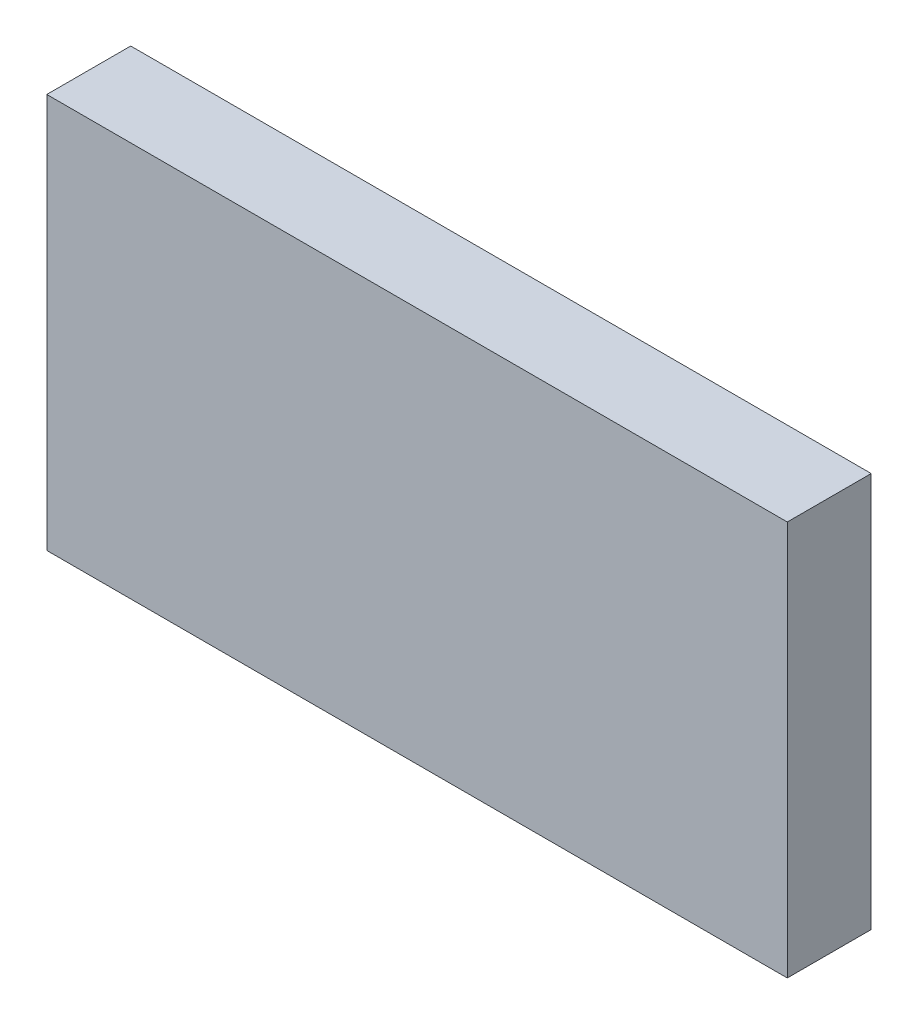
ISO-10303-21;
HEADER;
FILE_DESCRIPTION(('STEP AP214'),'2;1');
FILE_NAME('part.step','',(''),(''),'','','');
FILE_SCHEMA(('AUTOMOTIVE_DESIGN { 1 0 10303 214 1 1 1 1 }'));
ENDSEC;
DATA;
#1=APPLICATION_CONTEXT('core data for automotive mechanical design processes');
#2=APPLICATION_PROTOCOL_DEFINITION('international standard','automotive_design',2000,#1);
#3=PRODUCT_CONTEXT('',#1,'mechanical');
#4=PRODUCT('Part','Part','',(#3));
#5=PRODUCT_RELATED_PRODUCT_CATEGORY('part','',(#4));
#6=PRODUCT_DEFINITION_FORMATION('','',#4);
#7=PRODUCT_DEFINITION_CONTEXT('part definition',#1,'design');
#8=PRODUCT_DEFINITION('design','',#6,#7);
#9=PRODUCT_DEFINITION_SHAPE('','',#8);
#10=(LENGTH_UNIT() NAMED_UNIT(*) SI_UNIT(.MILLI.,.METRE.));
#11=(NAMED_UNIT(*) PLANE_ANGLE_UNIT() SI_UNIT($,.RADIAN.));
#12=(NAMED_UNIT(*) SI_UNIT($,.STERADIAN.) SOLID_ANGLE_UNIT());
#13=UNCERTAINTY_MEASURE_WITH_UNIT(LENGTH_MEASURE(1.E-05),#10,'distance_accuracy_value','');
#14=(GEOMETRIC_REPRESENTATION_CONTEXT(3) GLOBAL_UNCERTAINTY_ASSIGNED_CONTEXT((#13)) GLOBAL_UNIT_ASSIGNED_CONTEXT((#10,
#11,#12)) REPRESENTATION_CONTEXT('',''));
#15=CARTESIAN_POINT('',(0.,0.,0.));
#16=DIRECTION('',(0.,0.,1.));
#17=DIRECTION('',(1.,0.,0.));
#18=AXIS2_PLACEMENT_3D('',#15,#16,#17);
#19=CARTESIAN_POINT('',(-0.7499985,0.40000174,0.16999966));
#20=DIRECTION('',(0.,0.,1.));
#21=DIRECTION('',(1.,0.,0.));
#22=AXIS2_PLACEMENT_3D('',#19,#20,#21);
#23=PLANE('',#22);
#24=DIRECTION('',(0.,1.,0.));
#25=VECTOR('',#24,1.);
#26=CARTESIAN_POINT('',(0.75000104,0.40000174,0.16999966));
#27=LINE('',#26,#25);
#28=CARTESIAN_POINT('',(0.75000104,0.40000174,0.16999966));
#29=VERTEX_POINT('',#28);
#30=CARTESIAN_POINT('',(0.75000104,-0.3999992,0.16999966));
#31=VERTEX_POINT('',#30);
#32=EDGE_CURVE('E52',#29,#31,#27,.F.);
#33=ORIENTED_EDGE('',*,*,#32,.F.);
#34=DIRECTION('',(1.,0.,0.));
#35=VECTOR('',#34,1.);
#36=CARTESIAN_POINT('',(-0.7499985,0.40000174,0.16999966));
#37=LINE('',#36,#35);
#38=CARTESIAN_POINT('',(-0.7499985,0.40000174,0.16999966));
#39=VERTEX_POINT('',#38);
#40=EDGE_CURVE('E67',#39,#29,#37,.T.);
#41=ORIENTED_EDGE('',*,*,#40,.F.);
#42=DIRECTION('',(0.,1.,0.));
#43=VECTOR('',#42,1.);
#44=CARTESIAN_POINT('',(-0.7499985,-0.3999992,0.16999966));
#45=LINE('',#44,#43);
#46=CARTESIAN_POINT('',(-0.7499985,-0.3999992,0.16999966));
#47=VERTEX_POINT('',#46);
#48=EDGE_CURVE('E19',#47,#39,#45,.T.);
#49=ORIENTED_EDGE('',*,*,#48,.F.);
#50=DIRECTION('',(1.,0.,0.));
#51=VECTOR('',#50,1.);
#52=CARTESIAN_POINT('',(0.75000104,-0.3999992,0.16999966));
#53=LINE('',#52,#51);
#54=EDGE_CURVE('E57',#31,#47,#53,.F.);
#55=ORIENTED_EDGE('',*,*,#54,.F.);
#56=EDGE_LOOP('',(#33,#41,#49,#55));
#57=FACE_BOUND('',#56,.T.);
#58=ADVANCED_FACE('F16',(#57),#23,.T.);
#59=CARTESIAN_POINT('',(-0.7499985,-0.3999992,0.));
#60=DIRECTION('',(-1.,0.,0.));
#61=DIRECTION('',(0.,0.,1.));
#62=AXIS2_PLACEMENT_3D('',#59,#60,#61);
#63=PLANE('',#62);
#64=DIRECTION('',(0.,0.,1.));
#65=VECTOR('',#64,1.);
#66=CARTESIAN_POINT('',(-0.7499985,0.40000174,0.));
#67=LINE('',#66,#65);
#68=CARTESIAN_POINT('',(-0.7499985,0.40000174,0.));
#69=VERTEX_POINT('',#68);
#70=EDGE_CURVE('E78',#69,#39,#67,.T.);
#71=ORIENTED_EDGE('',*,*,#70,.F.);
#72=DIRECTION('',(0.,1.,0.));
#73=VECTOR('',#72,1.);
#74=CARTESIAN_POINT('',(-0.7499985,0.40000174,0.));
#75=LINE('',#74,#73);
#76=CARTESIAN_POINT('',(-0.7499985,-0.3999992,0.));
#77=VERTEX_POINT('',#76);
#78=EDGE_CURVE('E73',#69,#77,#75,.F.);
#79=ORIENTED_EDGE('',*,*,#78,.T.);
#80=DIRECTION('',(0.,0.,-1.));
#81=VECTOR('',#80,1.);
#82=CARTESIAN_POINT('',(-0.7499985,-0.3999992,0.));
#83=LINE('',#82,#81);
#84=EDGE_CURVE('E62',#47,#77,#83,.T.);
#85=ORIENTED_EDGE('',*,*,#84,.F.);
#86=ORIENTED_EDGE('',*,*,#48,.T.);
#87=EDGE_LOOP('',(#71,#79,#85,#86));
#88=FACE_BOUND('',#87,.T.);
#89=ADVANCED_FACE('F72',(#88),#63,.T.);
#90=CARTESIAN_POINT('',(0.75000104,-0.3999992,0.));
#91=DIRECTION('',(0.,-1.,0.));
#92=DIRECTION('',(0.,0.,-1.));
#93=AXIS2_PLACEMENT_3D('',#90,#91,#92);
#94=PLANE('',#93);
#95=ORIENTED_EDGE('',*,*,#84,.T.);
#96=DIRECTION('',(1.,0.,0.));
#97=VECTOR('',#96,1.);
#98=CARTESIAN_POINT('',(-0.7499985,-0.3999992,0.));
#99=LINE('',#98,#97);
#100=CARTESIAN_POINT('',(0.75000104,-0.3999992,0.));
#101=VERTEX_POINT('',#100);
#102=EDGE_CURVE('E83',#77,#101,#99,.T.);
#103=ORIENTED_EDGE('',*,*,#102,.T.);
#104=DIRECTION('',(0.,0.,-1.));
#105=VECTOR('',#104,1.);
#106=CARTESIAN_POINT('',(0.75000104,-0.3999992,0.));
#107=LINE('',#106,#105);
#108=EDGE_CURVE('E64',#31,#101,#107,.T.);
#109=ORIENTED_EDGE('',*,*,#108,.F.);
#110=ORIENTED_EDGE('',*,*,#54,.T.);
#111=EDGE_LOOP('',(#95,#103,#109,#110));
#112=FACE_BOUND('',#111,.T.);
#113=ADVANCED_FACE('F59',(#112),#94,.T.);
#114=CARTESIAN_POINT('',(0.75000104,0.40000174,0.));
#115=DIRECTION('',(1.,0.,0.));
#116=DIRECTION('',(0.,0.,-1.));
#117=AXIS2_PLACEMENT_3D('',#114,#115,#116);
#118=PLANE('',#117);
#119=ORIENTED_EDGE('',*,*,#108,.T.);
#120=DIRECTION('',(0.,1.,0.));
#121=VECTOR('',#120,1.);
#122=CARTESIAN_POINT('',(0.75000104,0.40000174,0.));
#123=LINE('',#122,#121);
#124=CARTESIAN_POINT('',(0.75000104,0.40000174,0.));
#125=VERTEX_POINT('',#124);
#126=EDGE_CURVE('E25',#101,#125,#123,.T.);
#127=ORIENTED_EDGE('',*,*,#126,.T.);
#128=DIRECTION('',(0.,0.,1.));
#129=VECTOR('',#128,1.);
#130=CARTESIAN_POINT('',(0.75000104,0.40000174,0.));
#131=LINE('',#130,#129);
#132=EDGE_CURVE('E33',#29,#125,#131,.F.);
#133=ORIENTED_EDGE('',*,*,#132,.F.);
#134=ORIENTED_EDGE('',*,*,#32,.T.);
#135=EDGE_LOOP('',(#119,#127,#133,#134));
#136=FACE_BOUND('',#135,.T.);
#137=ADVANCED_FACE('F87',(#136),#118,.T.);
#138=CARTESIAN_POINT('',(-0.7499985,0.40000174,0.));
#139=DIRECTION('',(0.,1.,0.));
#140=DIRECTION('',(0.,0.,1.));
#141=AXIS2_PLACEMENT_3D('',#138,#139,#140);
#142=PLANE('',#141);
#143=ORIENTED_EDGE('',*,*,#132,.T.);
#144=DIRECTION('',(1.,0.,0.));
#145=VECTOR('',#144,1.);
#146=CARTESIAN_POINT('',(-0.7499985,0.40000174,0.));
#147=LINE('',#146,#145);
#148=EDGE_CURVE('E11',#125,#69,#147,.F.);
#149=ORIENTED_EDGE('',*,*,#148,.T.);
#150=ORIENTED_EDGE('',*,*,#70,.T.);
#151=ORIENTED_EDGE('',*,*,#40,.T.);
#152=EDGE_LOOP('',(#143,#149,#150,#151));
#153=FACE_BOUND('',#152,.T.);
#154=ADVANCED_FACE('F90',(#153),#142,.T.);
#155=CARTESIAN_POINT('',(-0.7499985,0.40000174,0.));
#156=DIRECTION('',(0.,0.,1.));
#157=DIRECTION('',(1.,0.,0.));
#158=AXIS2_PLACEMENT_3D('',#155,#156,#157);
#159=PLANE('',#158);
#160=ORIENTED_EDGE('',*,*,#126,.F.);
#161=ORIENTED_EDGE('',*,*,#102,.F.);
#162=ORIENTED_EDGE('',*,*,#78,.F.);
#163=ORIENTED_EDGE('',*,*,#148,.F.);
#164=EDGE_LOOP('',(#160,#161,#162,#163));
#165=FACE_BOUND('',#164,.T.);
#166=ADVANCED_FACE('F89',(#165),#159,.F.);
#167=CLOSED_SHELL('',(#58,#89,#113,#137,#154,#166));
#168=MANIFOLD_SOLID_BREP('B1',#167);
#169=ADVANCED_BREP_SHAPE_REPRESENTATION('',(#18,#168),#14);
#170=SHAPE_DEFINITION_REPRESENTATION(#9,#169);
ENDSEC;
END-ISO-10303-21;
